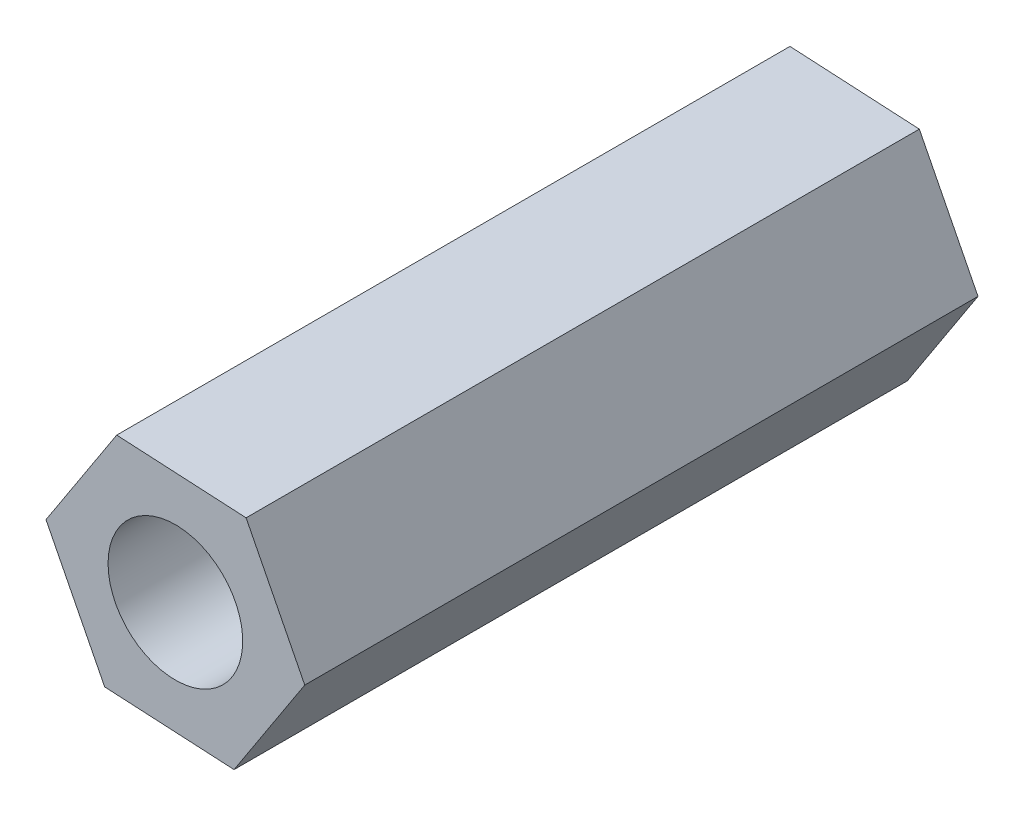
ISO-10303-21;
HEADER;
FILE_DESCRIPTION(('STEP AP214'),'2;1');
FILE_NAME('part.step','',(''),(''),'','','');
FILE_SCHEMA(('AUTOMOTIVE_DESIGN { 1 0 10303 214 1 1 1 1 }'));
ENDSEC;
DATA;
#1=APPLICATION_CONTEXT('core data for automotive mechanical design processes');
#2=APPLICATION_PROTOCOL_DEFINITION('international standard','automotive_design',2000,#1);
#3=PRODUCT_CONTEXT('',#1,'mechanical');
#4=PRODUCT('Part','Part','',(#3));
#5=PRODUCT_RELATED_PRODUCT_CATEGORY('part','',(#4));
#6=PRODUCT_DEFINITION_FORMATION('','',#4);
#7=PRODUCT_DEFINITION_CONTEXT('part definition',#1,'design');
#8=PRODUCT_DEFINITION('design','',#6,#7);
#9=PRODUCT_DEFINITION_SHAPE('','',#8);
#10=(LENGTH_UNIT() NAMED_UNIT(*) SI_UNIT(.MILLI.,.METRE.));
#11=(NAMED_UNIT(*) PLANE_ANGLE_UNIT() SI_UNIT($,.RADIAN.));
#12=(NAMED_UNIT(*) SI_UNIT($,.STERADIAN.) SOLID_ANGLE_UNIT());
#13=UNCERTAINTY_MEASURE_WITH_UNIT(LENGTH_MEASURE(1.E-05),#10,'distance_accuracy_value','');
#14=(GEOMETRIC_REPRESENTATION_CONTEXT(3) GLOBAL_UNCERTAINTY_ASSIGNED_CONTEXT((#13)) GLOBAL_UNIT_ASSIGNED_CONTEXT((#10,
#11,#12)) REPRESENTATION_CONTEXT('',''));
#15=CARTESIAN_POINT('',(0.,0.,0.));
#16=DIRECTION('',(0.,0.,1.));
#17=DIRECTION('',(1.,0.,0.));
#18=AXIS2_PLACEMENT_3D('',#15,#16,#17);
#19=CARTESIAN_POINT('',(2.8825916016709,-0.154916078280261,15.));
#20=DIRECTION('',(-0.891609732350342,-0.452804687672456,0.));
#21=DIRECTION('',(0.452804687672456,-0.891609732350343,0.));
#22=AXIS2_PLACEMENT_3D('',#19,#20,#21);
#23=PLANE('',#22);
#24=DIRECTION('',(-0.452804687672456,0.891609732350342,0.));
#25=VECTOR('',#24,1.);
#26=CARTESIAN_POINT('',(2.8825916016709,-0.154916078280261,0.));
#27=LINE('',#26,#25);
#28=CARTESIAN_POINT('',(2.8825916016709,-0.154916078280261,0.));
#29=VERTEX_POINT('',#28);
#30=CARTESIAN_POINT('',(1.57545706008081,2.41893951664254,0.));
#31=VERTEX_POINT('',#30);
#32=EDGE_CURVE('E116',#29,#31,#27,.T.);
#33=ORIENTED_EDGE('',*,*,#32,.T.);
#34=DIRECTION('',(0.,0.,-1.));
#35=VECTOR('',#34,1.);
#36=CARTESIAN_POINT('',(1.57545706008081,2.41893951664254,15.));
#37=LINE('',#36,#35);
#38=CARTESIAN_POINT('',(1.57545706008081,2.41893951664254,15.));
#39=VERTEX_POINT('',#38);
#40=EDGE_CURVE('E11',#39,#31,#37,.T.);
#41=ORIENTED_EDGE('',*,*,#40,.F.);
#42=DIRECTION('',(-0.452804687672456,0.891609732350342,0.));
#43=VECTOR('',#42,1.);
#44=CARTESIAN_POINT('',(2.8825916016709,-0.154916078280261,15.));
#45=LINE('',#44,#43);
#46=CARTESIAN_POINT('',(2.8825916016709,-0.154916078280261,15.));
#47=VERTEX_POINT('',#46);
#48=EDGE_CURVE('E127',#47,#39,#45,.T.);
#49=ORIENTED_EDGE('',*,*,#48,.F.);
#50=DIRECTION('',(0.,0.,-1.));
#51=VECTOR('',#50,1.);
#52=CARTESIAN_POINT('',(2.8825916016709,-0.154916078280261,15.));
#53=LINE('',#52,#51);
#54=EDGE_CURVE('E112',#47,#29,#53,.T.);
#55=ORIENTED_EDGE('',*,*,#54,.T.);
#56=EDGE_LOOP('',(#33,#41,#49,#55));
#57=FACE_BOUND('',#56,.T.);
#58=ADVANCED_FACE('F32',(#57),#23,.F.);
#59=CARTESIAN_POINT('',(1.57545706008081,2.41893951664254,15.));
#60=DIRECTION('',(-0.0536645036981452,-0.998559022313069,0.));
#61=DIRECTION('',(0.998559022313069,-0.0536645036981453,0.));
#62=AXIS2_PLACEMENT_3D('',#59,#60,#61);
#63=PLANE('',#62);
#64=DIRECTION('',(-0.998559022313069,0.0536645036981452,0.));
#65=VECTOR('',#64,1.);
#66=CARTESIAN_POINT('',(1.57545706008081,2.41893951664254,0.));
#67=LINE('',#66,#65);
#68=CARTESIAN_POINT('',(-1.30713454159008,2.5738555949228,0.));
#69=VERTEX_POINT('',#68);
#70=EDGE_CURVE('E119',#31,#69,#67,.T.);
#71=ORIENTED_EDGE('',*,*,#70,.T.);
#72=DIRECTION('',(0.,0.,-1.));
#73=VECTOR('',#72,1.);
#74=CARTESIAN_POINT('',(-1.30713454159008,2.5738555949228,15.));
#75=LINE('',#74,#73);
#76=CARTESIAN_POINT('',(-1.30713454159008,2.5738555949228,15.));
#77=VERTEX_POINT('',#76);
#78=EDGE_CURVE('E40',#77,#69,#75,.T.);
#79=ORIENTED_EDGE('',*,*,#78,.F.);
#80=DIRECTION('',(-0.998559022313069,0.0536645036981452,0.));
#81=VECTOR('',#80,1.);
#82=CARTESIAN_POINT('',(1.57545706008081,2.41893951664254,15.));
#83=LINE('',#82,#81);
#84=EDGE_CURVE('E85',#39,#77,#83,.T.);
#85=ORIENTED_EDGE('',*,*,#84,.F.);
#86=ORIENTED_EDGE('',*,*,#40,.T.);
#87=EDGE_LOOP('',(#71,#79,#85,#86));
#88=FACE_BOUND('',#87,.T.);
#89=ADVANCED_FACE('F152',(#88),#63,.F.);
#90=CARTESIAN_POINT('',(-1.30713454159008,2.5738555949228,15.));
#91=DIRECTION('',(0.837945228652197,-0.545754334640612,0.));
#92=DIRECTION('',(0.545754334640612,0.837945228652197,0.));
#93=AXIS2_PLACEMENT_3D('',#90,#91,#92);
#94=PLANE('',#93);
#95=DIRECTION('',(-0.545754334640612,-0.837945228652197,0.));
#96=VECTOR('',#95,1.);
#97=CARTESIAN_POINT('',(-1.30713454159008,2.5738555949228,0.));
#98=LINE('',#97,#96);
#99=CARTESIAN_POINT('',(-2.88259160167089,0.154916078280261,0.));
#100=VERTEX_POINT('',#99);
#101=EDGE_CURVE('E122',#69,#100,#98,.T.);
#102=ORIENTED_EDGE('',*,*,#101,.T.);
#103=DIRECTION('',(0.,0.,-1.));
#104=VECTOR('',#103,1.);
#105=CARTESIAN_POINT('',(-2.88259160167089,0.154916078280261,15.));
#106=LINE('',#105,#104);
#107=CARTESIAN_POINT('',(-2.88259160167089,0.154916078280261,15.));
#108=VERTEX_POINT('',#107);
#109=EDGE_CURVE('E107',#108,#100,#106,.T.);
#110=ORIENTED_EDGE('',*,*,#109,.F.);
#111=DIRECTION('',(-0.545754334640612,-0.837945228652197,0.));
#112=VECTOR('',#111,1.);
#113=CARTESIAN_POINT('',(-1.30713454159008,2.5738555949228,15.));
#114=LINE('',#113,#112);
#115=EDGE_CURVE('E98',#77,#108,#114,.T.);
#116=ORIENTED_EDGE('',*,*,#115,.F.);
#117=ORIENTED_EDGE('',*,*,#78,.T.);
#118=EDGE_LOOP('',(#102,#110,#116,#117));
#119=FACE_BOUND('',#118,.T.);
#120=ADVANCED_FACE('F133',(#119),#94,.F.);
#121=CARTESIAN_POINT('',(-2.88259160167089,0.154916078280261,15.));
#122=DIRECTION('',(0.891609732350343,0.452804687672456,0.));
#123=DIRECTION('',(-0.452804687672456,0.891609732350343,0.));
#124=AXIS2_PLACEMENT_3D('',#121,#122,#123);
#125=PLANE('',#124);
#126=DIRECTION('',(0.452804687672456,-0.891609732350343,0.));
#127=VECTOR('',#126,1.);
#128=CARTESIAN_POINT('',(-2.88259160167089,0.154916078280261,0.));
#129=LINE('',#128,#127);
#130=CARTESIAN_POINT('',(-1.57545706008081,-2.41893951664254,0.));
#131=VERTEX_POINT('',#130);
#132=EDGE_CURVE('E106',#100,#131,#129,.T.);
#133=ORIENTED_EDGE('',*,*,#132,.T.);
#134=DIRECTION('',(0.,0.,-1.));
#135=VECTOR('',#134,1.);
#136=CARTESIAN_POINT('',(-1.57545706008081,-2.41893951664254,15.));
#137=LINE('',#136,#135);
#138=CARTESIAN_POINT('',(-1.57545706008081,-2.41893951664254,15.));
#139=VERTEX_POINT('',#138);
#140=EDGE_CURVE('E103',#139,#131,#137,.T.);
#141=ORIENTED_EDGE('',*,*,#140,.F.);
#142=DIRECTION('',(0.452804687672456,-0.891609732350343,0.));
#143=VECTOR('',#142,1.);
#144=CARTESIAN_POINT('',(-2.88259160167089,0.154916078280261,15.));
#145=LINE('',#144,#143);
#146=EDGE_CURVE('E92',#108,#139,#145,.T.);
#147=ORIENTED_EDGE('',*,*,#146,.F.);
#148=ORIENTED_EDGE('',*,*,#109,.T.);
#149=EDGE_LOOP('',(#133,#141,#147,#148));
#150=FACE_BOUND('',#149,.T.);
#151=ADVANCED_FACE('F104',(#150),#125,.F.);
#152=CARTESIAN_POINT('',(-1.57545706008081,-2.41893951664254,15.));
#153=DIRECTION('',(0.0536645036981452,0.998559022313069,0.));
#154=DIRECTION('',(-0.998559022313069,0.0536645036981452,0.));
#155=AXIS2_PLACEMENT_3D('',#152,#153,#154);
#156=PLANE('',#155);
#157=DIRECTION('',(0.998559022313069,-0.0536645036981452,0.));
#158=VECTOR('',#157,1.);
#159=CARTESIAN_POINT('',(-1.57545706008081,-2.41893951664254,0.));
#160=LINE('',#159,#158);
#161=CARTESIAN_POINT('',(1.30713454159009,-2.5738555949228,0.));
#162=VERTEX_POINT('',#161);
#163=EDGE_CURVE('E71',#131,#162,#160,.T.);
#164=ORIENTED_EDGE('',*,*,#163,.T.);
#165=DIRECTION('',(0.,0.,-1.));
#166=VECTOR('',#165,1.);
#167=CARTESIAN_POINT('',(1.30713454159009,-2.5738555949228,15.));
#168=LINE('',#167,#166);
#169=CARTESIAN_POINT('',(1.30713454159009,-2.5738555949228,15.));
#170=VERTEX_POINT('',#169);
#171=EDGE_CURVE('E108',#170,#162,#168,.T.);
#172=ORIENTED_EDGE('',*,*,#171,.F.);
#173=DIRECTION('',(0.998559022313069,-0.0536645036981452,0.));
#174=VECTOR('',#173,1.);
#175=CARTESIAN_POINT('',(-1.57545706008081,-2.41893951664254,15.));
#176=LINE('',#175,#174);
#177=EDGE_CURVE('E96',#139,#170,#176,.T.);
#178=ORIENTED_EDGE('',*,*,#177,.F.);
#179=ORIENTED_EDGE('',*,*,#140,.T.);
#180=EDGE_LOOP('',(#164,#172,#178,#179));
#181=FACE_BOUND('',#180,.T.);
#182=ADVANCED_FACE('F110',(#181),#156,.F.);
#183=CARTESIAN_POINT('',(1.30713454159009,-2.5738555949228,15.));
#184=DIRECTION('',(-0.837945228652197,0.545754334640612,0.));
#185=DIRECTION('',(-0.545754334640612,-0.837945228652197,0.));
#186=AXIS2_PLACEMENT_3D('',#183,#184,#185);
#187=PLANE('',#186);
#188=DIRECTION('',(0.545754334640612,0.837945228652197,0.));
#189=VECTOR('',#188,1.);
#190=CARTESIAN_POINT('',(1.30713454159009,-2.5738555949228,0.));
#191=LINE('',#190,#189);
#192=EDGE_CURVE('E77',#162,#29,#191,.T.);
#193=ORIENTED_EDGE('',*,*,#192,.T.);
#194=ORIENTED_EDGE('',*,*,#54,.F.);
#195=DIRECTION('',(0.545754334640612,0.837945228652197,0.));
#196=VECTOR('',#195,1.);
#197=CARTESIAN_POINT('',(1.30713454159009,-2.5738555949228,15.));
#198=LINE('',#197,#196);
#199=EDGE_CURVE('E48',#170,#47,#198,.T.);
#200=ORIENTED_EDGE('',*,*,#199,.F.);
#201=ORIENTED_EDGE('',*,*,#171,.T.);
#202=EDGE_LOOP('',(#193,#194,#200,#201));
#203=FACE_BOUND('',#202,.T.);
#204=ADVANCED_FACE('F140',(#203),#187,.F.);
#205=CARTESIAN_POINT('',(1.57545706008081,2.41893951664254,15.));
#206=DIRECTION('',(0.,0.,1.));
#207=DIRECTION('',(1.,0.,0.));
#208=AXIS2_PLACEMENT_3D('',#205,#206,#207);
#209=PLANE('',#208);
#210=CARTESIAN_POINT('',(0.,0.,15.));
#211=DIRECTION('',(0.,0.,-1.));
#212=DIRECTION('',(-1.,0.,0.));
#213=AXIS2_PLACEMENT_3D('',#210,#211,#212);
#214=CIRCLE('',#213,1.5);
#215=CARTESIAN_POINT('',(-1.5,0.,15.));
#216=VERTEX_POINT('',#215);
#217=EDGE_CURVE('E120',#216,#216,#214,.T.);
#218=ORIENTED_EDGE('',*,*,#217,.T.);
#219=EDGE_LOOP('',(#218));
#220=FACE_BOUND('',#219,.T.);
#221=ORIENTED_EDGE('',*,*,#48,.T.);
#222=ORIENTED_EDGE('',*,*,#84,.T.);
#223=ORIENTED_EDGE('',*,*,#115,.T.);
#224=ORIENTED_EDGE('',*,*,#146,.T.);
#225=ORIENTED_EDGE('',*,*,#177,.T.);
#226=ORIENTED_EDGE('',*,*,#199,.T.);
#227=EDGE_LOOP('',(#221,#222,#223,#224,#225,#226));
#228=FACE_BOUND('',#227,.T.);
#229=ADVANCED_FACE('F94',(#220,#228),#209,.T.);
#230=CARTESIAN_POINT('',(1.57545706008081,2.41893951664254,0.));
#231=DIRECTION('',(0.,0.,1.));
#232=DIRECTION('',(1.,0.,0.));
#233=AXIS2_PLACEMENT_3D('',#230,#231,#232);
#234=PLANE('',#233);
#235=CARTESIAN_POINT('',(0.,0.,0.));
#236=DIRECTION('',(0.,0.,-1.));
#237=DIRECTION('',(-1.,0.,0.));
#238=AXIS2_PLACEMENT_3D('',#235,#236,#237);
#239=CIRCLE('',#238,1.5);
#240=CARTESIAN_POINT('',(-1.5,0.,0.));
#241=VERTEX_POINT('',#240);
#242=EDGE_CURVE('E207',#241,#241,#239,.T.);
#243=ORIENTED_EDGE('',*,*,#242,.F.);
#244=EDGE_LOOP('',(#243));
#245=FACE_BOUND('',#244,.T.);
#246=ORIENTED_EDGE('',*,*,#32,.F.);
#247=ORIENTED_EDGE('',*,*,#192,.F.);
#248=ORIENTED_EDGE('',*,*,#163,.F.);
#249=ORIENTED_EDGE('',*,*,#132,.F.);
#250=ORIENTED_EDGE('',*,*,#101,.F.);
#251=ORIENTED_EDGE('',*,*,#70,.F.);
#252=EDGE_LOOP('',(#246,#247,#248,#249,#250,#251));
#253=FACE_BOUND('',#252,.T.);
#254=ADVANCED_FACE('F136',(#245,#253),#234,.F.);
#255=CARTESIAN_POINT('',(0.,0.,15.));
#256=DIRECTION('',(0.,0.,-1.));
#257=DIRECTION('',(-1.,0.,0.));
#258=AXIS2_PLACEMENT_3D('',#255,#256,#257);
#259=CYLINDRICAL_SURFACE('',#258,1.5);
#260=ORIENTED_EDGE('',*,*,#217,.F.);
#261=EDGE_LOOP('',(#260));
#262=FACE_BOUND('',#261,.T.);
#263=ORIENTED_EDGE('',*,*,#242,.T.);
#264=EDGE_LOOP('',(#263));
#265=FACE_BOUND('',#264,.T.);
#266=ADVANCED_FACE('F189',(#262,#265),#259,.F.);
#267=CLOSED_SHELL('',(#58,#89,#120,#151,#182,#204,#229,#254,#266));
#268=MANIFOLD_SOLID_BREP('B2',#267);
#269=ADVANCED_BREP_SHAPE_REPRESENTATION('',(#18,#268),#14);
#270=SHAPE_DEFINITION_REPRESENTATION(#9,#269);
ENDSEC;
END-ISO-10303-21;
